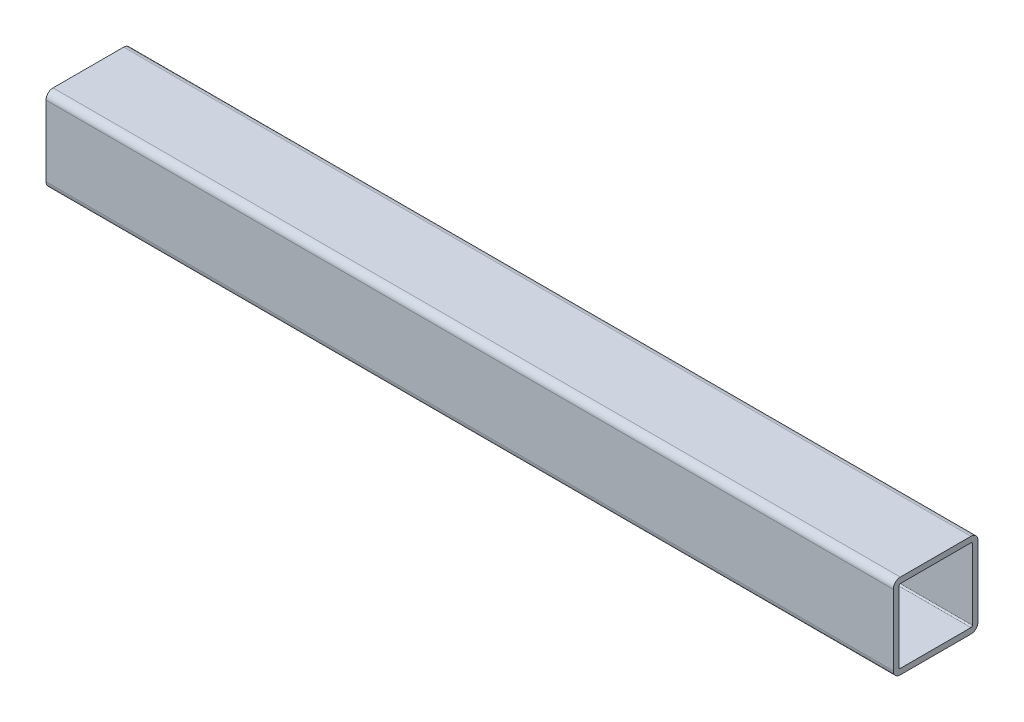
ISO-10303-21;
HEADER;
FILE_DESCRIPTION(('STEP AP214'),'2;1');
FILE_NAME('part.step','',(''),(''),'','','');
FILE_SCHEMA(('AUTOMOTIVE_DESIGN { 1 0 10303 214 1 1 1 1 }'));
ENDSEC;
DATA;
#1=APPLICATION_CONTEXT('core data for automotive mechanical design processes');
#2=APPLICATION_PROTOCOL_DEFINITION('international standard','automotive_design',2000,#1);
#3=PRODUCT_CONTEXT('',#1,'mechanical');
#4=PRODUCT('Part','Part','',(#3));
#5=PRODUCT_RELATED_PRODUCT_CATEGORY('part','',(#4));
#6=PRODUCT_DEFINITION_FORMATION('','',#4);
#7=PRODUCT_DEFINITION_CONTEXT('part definition',#1,'design');
#8=PRODUCT_DEFINITION('design','',#6,#7);
#9=PRODUCT_DEFINITION_SHAPE('','',#8);
#10=(LENGTH_UNIT() NAMED_UNIT(*) SI_UNIT(.MILLI.,.METRE.));
#11=(NAMED_UNIT(*) PLANE_ANGLE_UNIT() SI_UNIT($,.RADIAN.));
#12=(NAMED_UNIT(*) SI_UNIT($,.STERADIAN.) SOLID_ANGLE_UNIT());
#13=UNCERTAINTY_MEASURE_WITH_UNIT(LENGTH_MEASURE(1.E-05),#10,'distance_accuracy_value','');
#14=(GEOMETRIC_REPRESENTATION_CONTEXT(3) GLOBAL_UNCERTAINTY_ASSIGNED_CONTEXT((#13)) GLOBAL_UNIT_ASSIGNED_CONTEXT((#10,
#11,#12)) REPRESENTATION_CONTEXT('',''));
#15=CARTESIAN_POINT('',(0.,0.,0.));
#16=DIRECTION('',(0.,0.,1.));
#17=DIRECTION('',(1.,0.,0.));
#18=AXIS2_PLACEMENT_3D('',#15,#16,#17);
#19=CARTESIAN_POINT('',(190.5,-15.875,15.875));
#20=DIRECTION('',(1.,0.,0.));
#21=DIRECTION('',(0.,0.,-1.));
#22=AXIS2_PLACEMENT_3D('',#19,#20,#21);
#23=PLANE('',#22);
#24=CARTESIAN_POINT('',(190.5,-15.875,15.875));
#25=DIRECTION('',(1.,0.,0.));
#26=DIRECTION('',(0.,0.,-1.));
#27=AXIS2_PLACEMENT_3D('',#24,#25,#26);
#28=CIRCLE('',#27,3.175);
#29=CARTESIAN_POINT('',(190.5,-15.875,19.05));
#30=VERTEX_POINT('',#29);
#31=CARTESIAN_POINT('',(190.5,-19.05,15.875));
#32=VERTEX_POINT('',#31);
#33=EDGE_CURVE('E258',#30,#32,#28,.T.);
#34=ORIENTED_EDGE('',*,*,#33,.T.);
#35=DIRECTION('',(0.,0.,-1.));
#36=VECTOR('',#35,1.);
#37=CARTESIAN_POINT('',(190.5,-19.05,15.875));
#38=LINE('',#37,#36);
#39=CARTESIAN_POINT('',(190.5,-19.05,-15.875));
#40=VERTEX_POINT('',#39);
#41=EDGE_CURVE('E261',#32,#40,#38,.T.);
#42=ORIENTED_EDGE('',*,*,#41,.T.);
#43=CARTESIAN_POINT('',(190.5,-15.875,-15.875));
#44=DIRECTION('',(1.,0.,0.));
#45=DIRECTION('',(0.,0.,-1.));
#46=AXIS2_PLACEMENT_3D('',#43,#44,#45);
#47=CIRCLE('',#46,3.175);
#48=CARTESIAN_POINT('',(190.5,-15.875,-19.05));
#49=VERTEX_POINT('',#48);
#50=EDGE_CURVE('E264',#40,#49,#47,.T.);
#51=ORIENTED_EDGE('',*,*,#50,.T.);
#52=DIRECTION('',(0.,1.,0.));
#53=VECTOR('',#52,1.);
#54=CARTESIAN_POINT('',(190.5,15.875,-19.05));
#55=LINE('',#54,#53);
#56=CARTESIAN_POINT('',(190.5,15.875,-19.05));
#57=VERTEX_POINT('',#56);
#58=EDGE_CURVE('E266',#49,#57,#55,.T.);
#59=ORIENTED_EDGE('',*,*,#58,.T.);
#60=CARTESIAN_POINT('',(190.5,15.875,-15.875));
#61=DIRECTION('',(1.,0.,0.));
#62=DIRECTION('',(0.,0.,-1.));
#63=AXIS2_PLACEMENT_3D('',#60,#61,#62);
#64=CIRCLE('',#63,3.175);
#65=CARTESIAN_POINT('',(190.5,19.05,-15.875));
#66=VERTEX_POINT('',#65);
#67=EDGE_CURVE('E268',#57,#66,#64,.T.);
#68=ORIENTED_EDGE('',*,*,#67,.T.);
#69=DIRECTION('',(0.,0.,1.));
#70=VECTOR('',#69,1.);
#71=CARTESIAN_POINT('',(190.5,19.05,15.875));
#72=LINE('',#71,#70);
#73=CARTESIAN_POINT('',(190.5,19.05,15.875));
#74=VERTEX_POINT('',#73);
#75=EDGE_CURVE('E270',#66,#74,#72,.T.);
#76=ORIENTED_EDGE('',*,*,#75,.T.);
#77=CARTESIAN_POINT('',(190.5,15.875,15.875));
#78=DIRECTION('',(1.,0.,0.));
#79=DIRECTION('',(0.,0.,-1.));
#80=AXIS2_PLACEMENT_3D('',#77,#78,#79);
#81=CIRCLE('',#80,3.175);
#82=CARTESIAN_POINT('',(190.5,15.875,19.05));
#83=VERTEX_POINT('',#82);
#84=EDGE_CURVE('E272',#74,#83,#81,.T.);
#85=ORIENTED_EDGE('',*,*,#84,.T.);
#86=DIRECTION('',(0.,-1.,0.));
#87=VECTOR('',#86,1.);
#88=CARTESIAN_POINT('',(190.5,15.875,19.05));
#89=LINE('',#88,#87);
#90=EDGE_CURVE('E274',#83,#30,#89,.T.);
#91=ORIENTED_EDGE('',*,*,#90,.T.);
#92=EDGE_LOOP('',(#34,#42,#51,#59,#68,#76,#85,#91));
#93=FACE_BOUND('',#92,.T.);
#94=DIRECTION('',(0.,0.,-1.));
#95=VECTOR('',#94,1.);
#96=CARTESIAN_POINT('',(190.5,-16.51,15.875));
#97=LINE('',#96,#95);
#98=CARTESIAN_POINT('',(190.5,-16.51,15.875));
#99=VERTEX_POINT('',#98);
#100=CARTESIAN_POINT('',(190.5,-16.51,-15.875));
#101=VERTEX_POINT('',#100);
#102=EDGE_CURVE('E201',#99,#101,#97,.T.);
#103=ORIENTED_EDGE('',*,*,#102,.F.);
#104=CARTESIAN_POINT('',(190.5,-15.875,15.875));
#105=DIRECTION('',(1.,0.,0.));
#106=DIRECTION('',(0.,0.,-1.));
#107=AXIS2_PLACEMENT_3D('',#104,#105,#106);
#108=CIRCLE('',#107,0.635000000000002);
#109=CARTESIAN_POINT('',(190.5,-15.875,16.51));
#110=VERTEX_POINT('',#109);
#111=EDGE_CURVE('E193',#110,#99,#108,.T.);
#112=ORIENTED_EDGE('',*,*,#111,.F.);
#113=DIRECTION('',(0.,-1.,0.));
#114=VECTOR('',#113,1.);
#115=CARTESIAN_POINT('',(190.5,15.875,16.51));
#116=LINE('',#115,#114);
#117=CARTESIAN_POINT('',(190.5,15.875,16.51));
#118=VERTEX_POINT('',#117);
#119=EDGE_CURVE('E226',#118,#110,#116,.T.);
#120=ORIENTED_EDGE('',*,*,#119,.F.);
#121=CARTESIAN_POINT('',(190.5,15.875,15.875));
#122=DIRECTION('',(1.,0.,0.));
#123=DIRECTION('',(0.,0.,-1.));
#124=AXIS2_PLACEMENT_3D('',#121,#122,#123);
#125=CIRCLE('',#124,0.635000000000004);
#126=CARTESIAN_POINT('',(190.5,16.51,15.875));
#127=VERTEX_POINT('',#126);
#128=EDGE_CURVE('E224',#127,#118,#125,.T.);
#129=ORIENTED_EDGE('',*,*,#128,.F.);
#130=DIRECTION('',(0.,0.,1.));
#131=VECTOR('',#130,1.);
#132=CARTESIAN_POINT('',(190.5,16.51,15.875));
#133=LINE('',#132,#131);
#134=CARTESIAN_POINT('',(190.5,16.51,-15.875));
#135=VERTEX_POINT('',#134);
#136=EDGE_CURVE('E222',#135,#127,#133,.T.);
#137=ORIENTED_EDGE('',*,*,#136,.F.);
#138=CARTESIAN_POINT('',(190.5,15.875,-15.875));
#139=DIRECTION('',(1.,0.,0.));
#140=DIRECTION('',(0.,0.,-1.));
#141=AXIS2_PLACEMENT_3D('',#138,#139,#140);
#142=CIRCLE('',#141,0.635000000000004);
#143=CARTESIAN_POINT('',(190.5,15.875,-16.51));
#144=VERTEX_POINT('',#143);
#145=EDGE_CURVE('E220',#144,#135,#142,.T.);
#146=ORIENTED_EDGE('',*,*,#145,.F.);
#147=DIRECTION('',(0.,1.,0.));
#148=VECTOR('',#147,1.);
#149=CARTESIAN_POINT('',(190.5,15.875,-16.51));
#150=LINE('',#149,#148);
#151=CARTESIAN_POINT('',(190.5,-15.875,-16.51));
#152=VERTEX_POINT('',#151);
#153=EDGE_CURVE('E216',#152,#144,#150,.T.);
#154=ORIENTED_EDGE('',*,*,#153,.F.);
#155=CARTESIAN_POINT('',(190.5,-15.875,-15.875));
#156=DIRECTION('',(1.,0.,0.));
#157=DIRECTION('',(0.,0.,-1.));
#158=AXIS2_PLACEMENT_3D('',#155,#156,#157);
#159=CIRCLE('',#158,0.634999999999999);
#160=EDGE_CURVE('E214',#101,#152,#159,.T.);
#161=ORIENTED_EDGE('',*,*,#160,.F.);
#162=EDGE_LOOP('',(#103,#112,#120,#129,#137,#146,#154,#161));
#163=FACE_BOUND('',#162,.T.);
#164=ADVANCED_FACE('F80',(#93,#163),#23,.T.);
#165=CARTESIAN_POINT('',(-190.5,-15.875,15.875));
#166=DIRECTION('',(1.,0.,0.));
#167=DIRECTION('',(0.,0.,-1.));
#168=AXIS2_PLACEMENT_3D('',#165,#166,#167);
#169=PLANE('',#168);
#170=CARTESIAN_POINT('',(-190.5,-15.875,15.875));
#171=DIRECTION('',(1.,0.,0.));
#172=DIRECTION('',(0.,0.,-1.));
#173=AXIS2_PLACEMENT_3D('',#170,#171,#172);
#174=CIRCLE('',#173,3.175);
#175=CARTESIAN_POINT('',(-190.5,-15.875,19.05));
#176=VERTEX_POINT('',#175);
#177=CARTESIAN_POINT('',(-190.5,-19.05,15.875));
#178=VERTEX_POINT('',#177);
#179=EDGE_CURVE('E209',#176,#178,#174,.T.);
#180=ORIENTED_EDGE('',*,*,#179,.F.);
#181=DIRECTION('',(0.,-1.,0.));
#182=VECTOR('',#181,1.);
#183=CARTESIAN_POINT('',(-190.5,15.875,19.05));
#184=LINE('',#183,#182);
#185=CARTESIAN_POINT('',(-190.5,15.875,19.05));
#186=VERTEX_POINT('',#185);
#187=EDGE_CURVE('E262',#186,#176,#184,.T.);
#188=ORIENTED_EDGE('',*,*,#187,.F.);
#189=CARTESIAN_POINT('',(-190.5,15.875,15.875));
#190=DIRECTION('',(1.,0.,0.));
#191=DIRECTION('',(0.,0.,-1.));
#192=AXIS2_PLACEMENT_3D('',#189,#190,#191);
#193=CIRCLE('',#192,3.175);
#194=CARTESIAN_POINT('',(-190.5,19.05,15.875));
#195=VERTEX_POINT('',#194);
#196=EDGE_CURVE('E289',#195,#186,#193,.T.);
#197=ORIENTED_EDGE('',*,*,#196,.F.);
#198=DIRECTION('',(0.,0.,1.));
#199=VECTOR('',#198,1.);
#200=CARTESIAN_POINT('',(-190.5,19.05,15.875));
#201=LINE('',#200,#199);
#202=CARTESIAN_POINT('',(-190.5,19.05,-15.875));
#203=VERTEX_POINT('',#202);
#204=EDGE_CURVE('E287',#203,#195,#201,.T.);
#205=ORIENTED_EDGE('',*,*,#204,.F.);
#206=CARTESIAN_POINT('',(-190.5,15.875,-15.875));
#207=DIRECTION('',(1.,0.,0.));
#208=DIRECTION('',(0.,0.,-1.));
#209=AXIS2_PLACEMENT_3D('',#206,#207,#208);
#210=CIRCLE('',#209,3.175);
#211=CARTESIAN_POINT('',(-190.5,15.875,-19.05));
#212=VERTEX_POINT('',#211);
#213=EDGE_CURVE('E285',#212,#203,#210,.T.);
#214=ORIENTED_EDGE('',*,*,#213,.F.);
#215=DIRECTION('',(0.,1.,0.));
#216=VECTOR('',#215,1.);
#217=CARTESIAN_POINT('',(-190.5,15.875,-19.05));
#218=LINE('',#217,#216);
#219=CARTESIAN_POINT('',(-190.5,-15.875,-19.05));
#220=VERTEX_POINT('',#219);
#221=EDGE_CURVE('E283',#220,#212,#218,.T.);
#222=ORIENTED_EDGE('',*,*,#221,.F.);
#223=CARTESIAN_POINT('',(-190.5,-15.875,-15.875));
#224=DIRECTION('',(1.,0.,0.));
#225=DIRECTION('',(0.,0.,-1.));
#226=AXIS2_PLACEMENT_3D('',#223,#224,#225);
#227=CIRCLE('',#226,3.175);
#228=CARTESIAN_POINT('',(-190.5,-19.05,-15.875));
#229=VERTEX_POINT('',#228);
#230=EDGE_CURVE('E281',#229,#220,#227,.T.);
#231=ORIENTED_EDGE('',*,*,#230,.F.);
#232=DIRECTION('',(0.,0.,-1.));
#233=VECTOR('',#232,1.);
#234=CARTESIAN_POINT('',(-190.5,-19.05,15.875));
#235=LINE('',#234,#233);
#236=EDGE_CURVE('E279',#178,#229,#235,.T.);
#237=ORIENTED_EDGE('',*,*,#236,.F.);
#238=EDGE_LOOP('',(#180,#188,#197,#205,#214,#222,#231,#237));
#239=FACE_BOUND('',#238,.T.);
#240=CARTESIAN_POINT('',(-190.5,-15.875,15.875));
#241=DIRECTION('',(1.,0.,0.));
#242=DIRECTION('',(0.,0.,-1.));
#243=AXIS2_PLACEMENT_3D('',#240,#241,#242);
#244=CIRCLE('',#243,0.635000000000002);
#245=CARTESIAN_POINT('',(-190.5,-15.875,16.51));
#246=VERTEX_POINT('',#245);
#247=CARTESIAN_POINT('',(-190.5,-16.51,15.875));
#248=VERTEX_POINT('',#247);
#249=EDGE_CURVE('E103',#246,#248,#244,.T.);
#250=ORIENTED_EDGE('',*,*,#249,.T.);
#251=DIRECTION('',(0.,0.,-1.));
#252=VECTOR('',#251,1.);
#253=CARTESIAN_POINT('',(-190.5,-16.51,15.875));
#254=LINE('',#253,#252);
#255=CARTESIAN_POINT('',(-190.5,-16.51,-15.875));
#256=VERTEX_POINT('',#255);
#257=EDGE_CURVE('E208',#248,#256,#254,.T.);
#258=ORIENTED_EDGE('',*,*,#257,.T.);
#259=CARTESIAN_POINT('',(-190.5,-15.875,-15.875));
#260=DIRECTION('',(1.,0.,0.));
#261=DIRECTION('',(0.,0.,-1.));
#262=AXIS2_PLACEMENT_3D('',#259,#260,#261);
#263=CIRCLE('',#262,0.634999999999999);
#264=CARTESIAN_POINT('',(-190.5,-15.875,-16.51));
#265=VERTEX_POINT('',#264);
#266=EDGE_CURVE('E230',#256,#265,#263,.T.);
#267=ORIENTED_EDGE('',*,*,#266,.T.);
#268=DIRECTION('',(0.,1.,0.));
#269=VECTOR('',#268,1.);
#270=CARTESIAN_POINT('',(-190.5,15.875,-16.51));
#271=LINE('',#270,#269);
#272=CARTESIAN_POINT('',(-190.5,15.875,-16.51));
#273=VERTEX_POINT('',#272);
#274=EDGE_CURVE('E233',#265,#273,#271,.T.);
#275=ORIENTED_EDGE('',*,*,#274,.T.);
#276=CARTESIAN_POINT('',(-190.5,15.875,-15.875));
#277=DIRECTION('',(1.,0.,0.));
#278=DIRECTION('',(0.,0.,-1.));
#279=AXIS2_PLACEMENT_3D('',#276,#277,#278);
#280=CIRCLE('',#279,0.635000000000004);
#281=CARTESIAN_POINT('',(-190.5,16.51,-15.875));
#282=VERTEX_POINT('',#281);
#283=EDGE_CURVE('E236',#273,#282,#280,.T.);
#284=ORIENTED_EDGE('',*,*,#283,.T.);
#285=DIRECTION('',(0.,0.,1.));
#286=VECTOR('',#285,1.);
#287=CARTESIAN_POINT('',(-190.5,16.51,15.875));
#288=LINE('',#287,#286);
#289=CARTESIAN_POINT('',(-190.5,16.51,15.875));
#290=VERTEX_POINT('',#289);
#291=EDGE_CURVE('E239',#282,#290,#288,.T.);
#292=ORIENTED_EDGE('',*,*,#291,.T.);
#293=CARTESIAN_POINT('',(-190.5,15.875,15.875));
#294=DIRECTION('',(1.,0.,0.));
#295=DIRECTION('',(0.,0.,-1.));
#296=AXIS2_PLACEMENT_3D('',#293,#294,#295);
#297=CIRCLE('',#296,0.635000000000004);
#298=CARTESIAN_POINT('',(-190.5,15.875,16.51));
#299=VERTEX_POINT('',#298);
#300=EDGE_CURVE('E242',#290,#299,#297,.T.);
#301=ORIENTED_EDGE('',*,*,#300,.T.);
#302=DIRECTION('',(0.,-1.,0.));
#303=VECTOR('',#302,1.);
#304=CARTESIAN_POINT('',(-190.5,15.875,16.51));
#305=LINE('',#304,#303);
#306=EDGE_CURVE('E202',#299,#246,#305,.T.);
#307=ORIENTED_EDGE('',*,*,#306,.T.);
#308=EDGE_LOOP('',(#250,#258,#267,#275,#284,#292,#301,#307));
#309=FACE_BOUND('',#308,.T.);
#310=ADVANCED_FACE('F319',(#239,#309),#169,.F.);
#311=CARTESIAN_POINT('',(190.5,-15.875,15.875));
#312=DIRECTION('',(-1.,0.,0.));
#313=DIRECTION('',(0.,0.,1.));
#314=AXIS2_PLACEMENT_3D('',#311,#312,#313);
#315=CYLINDRICAL_SURFACE('',#314,3.175);
#316=ORIENTED_EDGE('',*,*,#179,.T.);
#317=DIRECTION('',(-1.,0.,0.));
#318=VECTOR('',#317,1.);
#319=CARTESIAN_POINT('',(190.5,-19.05,15.875));
#320=LINE('',#319,#318);
#321=EDGE_CURVE('E12',#32,#178,#320,.T.);
#322=ORIENTED_EDGE('',*,*,#321,.F.);
#323=ORIENTED_EDGE('',*,*,#33,.F.);
#324=DIRECTION('',(-1.,0.,0.));
#325=VECTOR('',#324,1.);
#326=CARTESIAN_POINT('',(190.5,-15.875,19.05));
#327=LINE('',#326,#325);
#328=EDGE_CURVE('E276',#30,#176,#327,.T.);
#329=ORIENTED_EDGE('',*,*,#328,.T.);
#330=EDGE_LOOP('',(#316,#322,#323,#329));
#331=FACE_BOUND('',#330,.T.);
#332=ADVANCED_FACE('F82',(#331),#315,.T.);
#333=CARTESIAN_POINT('',(190.5,-19.05,15.875));
#334=DIRECTION('',(0.,1.,0.));
#335=DIRECTION('',(0.,0.,1.));
#336=AXIS2_PLACEMENT_3D('',#333,#334,#335);
#337=PLANE('',#336);
#338=ORIENTED_EDGE('',*,*,#236,.T.);
#339=DIRECTION('',(-1.,0.,0.));
#340=VECTOR('',#339,1.);
#341=CARTESIAN_POINT('',(190.5,-19.05,-15.875));
#342=LINE('',#341,#340);
#343=EDGE_CURVE('E88',#40,#229,#342,.T.);
#344=ORIENTED_EDGE('',*,*,#343,.F.);
#345=ORIENTED_EDGE('',*,*,#41,.F.);
#346=ORIENTED_EDGE('',*,*,#321,.T.);
#347=EDGE_LOOP('',(#338,#344,#345,#346));
#348=FACE_BOUND('',#347,.T.);
#349=ADVANCED_FACE('F336',(#348),#337,.F.);
#350=CARTESIAN_POINT('',(190.5,-15.875,-15.875));
#351=DIRECTION('',(-1.,0.,0.));
#352=DIRECTION('',(0.,0.,1.));
#353=AXIS2_PLACEMENT_3D('',#350,#351,#352);
#354=CYLINDRICAL_SURFACE('',#353,3.175);
#355=ORIENTED_EDGE('',*,*,#230,.T.);
#356=DIRECTION('',(-1.,0.,0.));
#357=VECTOR('',#356,1.);
#358=CARTESIAN_POINT('',(190.5,-15.875,-19.05));
#359=LINE('',#358,#357);
#360=EDGE_CURVE('E306',#49,#220,#359,.T.);
#361=ORIENTED_EDGE('',*,*,#360,.F.);
#362=ORIENTED_EDGE('',*,*,#50,.F.);
#363=ORIENTED_EDGE('',*,*,#343,.T.);
#364=EDGE_LOOP('',(#355,#361,#362,#363));
#365=FACE_BOUND('',#364,.T.);
#366=ADVANCED_FACE('F313',(#365),#354,.T.);
#367=CARTESIAN_POINT('',(190.5,15.875,-19.05));
#368=DIRECTION('',(0.,0.,1.));
#369=DIRECTION('',(0.,-1.,0.));
#370=AXIS2_PLACEMENT_3D('',#367,#368,#369);
#371=PLANE('',#370);
#372=ORIENTED_EDGE('',*,*,#221,.T.);
#373=DIRECTION('',(-1.,0.,0.));
#374=VECTOR('',#373,1.);
#375=CARTESIAN_POINT('',(190.5,15.875,-19.05));
#376=LINE('',#375,#374);
#377=EDGE_CURVE('E303',#57,#212,#376,.T.);
#378=ORIENTED_EDGE('',*,*,#377,.F.);
#379=ORIENTED_EDGE('',*,*,#58,.F.);
#380=ORIENTED_EDGE('',*,*,#360,.T.);
#381=EDGE_LOOP('',(#372,#378,#379,#380));
#382=FACE_BOUND('',#381,.T.);
#383=ADVANCED_FACE('F325',(#382),#371,.F.);
#384=CARTESIAN_POINT('',(190.5,15.875,-15.875));
#385=DIRECTION('',(-1.,0.,0.));
#386=DIRECTION('',(0.,0.,1.));
#387=AXIS2_PLACEMENT_3D('',#384,#385,#386);
#388=CYLINDRICAL_SURFACE('',#387,3.175);
#389=ORIENTED_EDGE('',*,*,#213,.T.);
#390=DIRECTION('',(-1.,0.,0.));
#391=VECTOR('',#390,1.);
#392=CARTESIAN_POINT('',(190.5,19.05,-15.875));
#393=LINE('',#392,#391);
#394=EDGE_CURVE('E300',#66,#203,#393,.T.);
#395=ORIENTED_EDGE('',*,*,#394,.F.);
#396=ORIENTED_EDGE('',*,*,#67,.F.);
#397=ORIENTED_EDGE('',*,*,#377,.T.);
#398=EDGE_LOOP('',(#389,#395,#396,#397));
#399=FACE_BOUND('',#398,.T.);
#400=ADVANCED_FACE('F329',(#399),#388,.T.);
#401=CARTESIAN_POINT('',(190.5,19.05,15.875));
#402=DIRECTION('',(0.,-1.,0.));
#403=DIRECTION('',(0.,0.,-1.));
#404=AXIS2_PLACEMENT_3D('',#401,#402,#403);
#405=PLANE('',#404);
#406=ORIENTED_EDGE('',*,*,#204,.T.);
#407=DIRECTION('',(-1.,0.,0.));
#408=VECTOR('',#407,1.);
#409=CARTESIAN_POINT('',(190.5,19.05,15.875));
#410=LINE('',#409,#408);
#411=EDGE_CURVE('E297',#74,#195,#410,.T.);
#412=ORIENTED_EDGE('',*,*,#411,.F.);
#413=ORIENTED_EDGE('',*,*,#75,.F.);
#414=ORIENTED_EDGE('',*,*,#394,.T.);
#415=EDGE_LOOP('',(#406,#412,#413,#414));
#416=FACE_BOUND('',#415,.T.);
#417=ADVANCED_FACE('F349',(#416),#405,.F.);
#418=CARTESIAN_POINT('',(190.5,15.875,15.875));
#419=DIRECTION('',(-1.,0.,0.));
#420=DIRECTION('',(0.,0.,1.));
#421=AXIS2_PLACEMENT_3D('',#418,#419,#420);
#422=CYLINDRICAL_SURFACE('',#421,3.175);
#423=ORIENTED_EDGE('',*,*,#196,.T.);
#424=DIRECTION('',(-1.,0.,0.));
#425=VECTOR('',#424,1.);
#426=CARTESIAN_POINT('',(190.5,15.875,19.05));
#427=LINE('',#426,#425);
#428=EDGE_CURVE('E294',#83,#186,#427,.T.);
#429=ORIENTED_EDGE('',*,*,#428,.F.);
#430=ORIENTED_EDGE('',*,*,#84,.F.);
#431=ORIENTED_EDGE('',*,*,#411,.T.);
#432=EDGE_LOOP('',(#423,#429,#430,#431));
#433=FACE_BOUND('',#432,.T.);
#434=ADVANCED_FACE('F347',(#433),#422,.T.);
#435=CARTESIAN_POINT('',(190.5,15.875,19.05));
#436=DIRECTION('',(0.,0.,-1.));
#437=DIRECTION('',(0.,1.,0.));
#438=AXIS2_PLACEMENT_3D('',#435,#436,#437);
#439=PLANE('',#438);
#440=ORIENTED_EDGE('',*,*,#187,.T.);
#441=ORIENTED_EDGE('',*,*,#328,.F.);
#442=ORIENTED_EDGE('',*,*,#90,.F.);
#443=ORIENTED_EDGE('',*,*,#428,.T.);
#444=EDGE_LOOP('',(#440,#441,#442,#443));
#445=FACE_BOUND('',#444,.T.);
#446=ADVANCED_FACE('F342',(#445),#439,.F.);
#447=CARTESIAN_POINT('',(190.5,-15.875,15.875));
#448=DIRECTION('',(-1.,0.,0.));
#449=DIRECTION('',(0.,0.,1.));
#450=AXIS2_PLACEMENT_3D('',#447,#448,#449);
#451=CYLINDRICAL_SURFACE('',#450,0.635000000000002);
#452=ORIENTED_EDGE('',*,*,#249,.F.);
#453=DIRECTION('',(-1.,0.,0.));
#454=VECTOR('',#453,1.);
#455=CARTESIAN_POINT('',(190.5,-15.875,16.51));
#456=LINE('',#455,#454);
#457=EDGE_CURVE('E197',#110,#246,#456,.T.);
#458=ORIENTED_EDGE('',*,*,#457,.F.);
#459=ORIENTED_EDGE('',*,*,#111,.T.);
#460=DIRECTION('',(-1.,0.,0.));
#461=VECTOR('',#460,1.);
#462=CARTESIAN_POINT('',(190.5,-16.51,15.875));
#463=LINE('',#462,#461);
#464=EDGE_CURVE('E196',#99,#248,#463,.T.);
#465=ORIENTED_EDGE('',*,*,#464,.T.);
#466=EDGE_LOOP('',(#452,#458,#459,#465));
#467=FACE_BOUND('',#466,.T.);
#468=ADVANCED_FACE('F195',(#467),#451,.F.);
#469=CARTESIAN_POINT('',(190.5,-16.51,15.875));
#470=DIRECTION('',(0.,1.,0.));
#471=DIRECTION('',(0.,0.,1.));
#472=AXIS2_PLACEMENT_3D('',#469,#470,#471);
#473=PLANE('',#472);
#474=ORIENTED_EDGE('',*,*,#257,.F.);
#475=ORIENTED_EDGE('',*,*,#464,.F.);
#476=ORIENTED_EDGE('',*,*,#102,.T.);
#477=DIRECTION('',(-1.,0.,0.));
#478=VECTOR('',#477,1.);
#479=CARTESIAN_POINT('',(190.5,-16.51,-15.875));
#480=LINE('',#479,#478);
#481=EDGE_CURVE('E210',#101,#256,#480,.T.);
#482=ORIENTED_EDGE('',*,*,#481,.T.);
#483=EDGE_LOOP('',(#474,#475,#476,#482));
#484=FACE_BOUND('',#483,.T.);
#485=ADVANCED_FACE('F205',(#484),#473,.T.);
#486=CARTESIAN_POINT('',(190.5,-15.875,-15.875));
#487=DIRECTION('',(-1.,0.,0.));
#488=DIRECTION('',(0.,0.,1.));
#489=AXIS2_PLACEMENT_3D('',#486,#487,#488);
#490=CYLINDRICAL_SURFACE('',#489,0.634999999999999);
#491=ORIENTED_EDGE('',*,*,#266,.F.);
#492=ORIENTED_EDGE('',*,*,#481,.F.);
#493=ORIENTED_EDGE('',*,*,#160,.T.);
#494=DIRECTION('',(-1.,0.,0.));
#495=VECTOR('',#494,1.);
#496=CARTESIAN_POINT('',(190.5,-15.875,-16.51));
#497=LINE('',#496,#495);
#498=EDGE_CURVE('E255',#152,#265,#497,.T.);
#499=ORIENTED_EDGE('',*,*,#498,.T.);
#500=EDGE_LOOP('',(#491,#492,#493,#499));
#501=FACE_BOUND('',#500,.T.);
#502=ADVANCED_FACE('F374',(#501),#490,.F.);
#503=CARTESIAN_POINT('',(190.5,15.875,-16.51));
#504=DIRECTION('',(0.,0.,1.));
#505=DIRECTION('',(0.,-1.,0.));
#506=AXIS2_PLACEMENT_3D('',#503,#504,#505);
#507=PLANE('',#506);
#508=ORIENTED_EDGE('',*,*,#274,.F.);
#509=ORIENTED_EDGE('',*,*,#498,.F.);
#510=ORIENTED_EDGE('',*,*,#153,.T.);
#511=DIRECTION('',(-1.,0.,0.));
#512=VECTOR('',#511,1.);
#513=CARTESIAN_POINT('',(190.5,15.875,-16.51));
#514=LINE('',#513,#512);
#515=EDGE_CURVE('E253',#144,#273,#514,.T.);
#516=ORIENTED_EDGE('',*,*,#515,.T.);
#517=EDGE_LOOP('',(#508,#509,#510,#516));
#518=FACE_BOUND('',#517,.T.);
#519=ADVANCED_FACE('F378',(#518),#507,.T.);
#520=CARTESIAN_POINT('',(190.5,15.875,-15.875));
#521=DIRECTION('',(-1.,0.,0.));
#522=DIRECTION('',(0.,0.,1.));
#523=AXIS2_PLACEMENT_3D('',#520,#521,#522);
#524=CYLINDRICAL_SURFACE('',#523,0.635000000000004);
#525=ORIENTED_EDGE('',*,*,#283,.F.);
#526=ORIENTED_EDGE('',*,*,#515,.F.);
#527=ORIENTED_EDGE('',*,*,#145,.T.);
#528=DIRECTION('',(-1.,0.,0.));
#529=VECTOR('',#528,1.);
#530=CARTESIAN_POINT('',(190.5,16.51,-15.875));
#531=LINE('',#530,#529);
#532=EDGE_CURVE('E251',#135,#282,#531,.T.);
#533=ORIENTED_EDGE('',*,*,#532,.T.);
#534=EDGE_LOOP('',(#525,#526,#527,#533));
#535=FACE_BOUND('',#534,.T.);
#536=ADVANCED_FACE('F384',(#535),#524,.F.);
#537=CARTESIAN_POINT('',(190.5,16.51,15.875));
#538=DIRECTION('',(0.,-1.,0.));
#539=DIRECTION('',(0.,0.,-1.));
#540=AXIS2_PLACEMENT_3D('',#537,#538,#539);
#541=PLANE('',#540);
#542=ORIENTED_EDGE('',*,*,#291,.F.);
#543=ORIENTED_EDGE('',*,*,#532,.F.);
#544=ORIENTED_EDGE('',*,*,#136,.T.);
#545=DIRECTION('',(-1.,0.,0.));
#546=VECTOR('',#545,1.);
#547=CARTESIAN_POINT('',(190.5,16.51,15.875));
#548=LINE('',#547,#546);
#549=EDGE_CURVE('E249',#127,#290,#548,.T.);
#550=ORIENTED_EDGE('',*,*,#549,.T.);
#551=EDGE_LOOP('',(#542,#543,#544,#550));
#552=FACE_BOUND('',#551,.T.);
#553=ADVANCED_FACE('F388',(#552),#541,.T.);
#554=CARTESIAN_POINT('',(190.5,15.875,15.875));
#555=DIRECTION('',(-1.,0.,0.));
#556=DIRECTION('',(0.,0.,1.));
#557=AXIS2_PLACEMENT_3D('',#554,#555,#556);
#558=CYLINDRICAL_SURFACE('',#557,0.635000000000004);
#559=ORIENTED_EDGE('',*,*,#300,.F.);
#560=ORIENTED_EDGE('',*,*,#549,.F.);
#561=ORIENTED_EDGE('',*,*,#128,.T.);
#562=DIRECTION('',(-1.,0.,0.));
#563=VECTOR('',#562,1.);
#564=CARTESIAN_POINT('',(190.5,15.875,16.51));
#565=LINE('',#564,#563);
#566=EDGE_CURVE('E95',#118,#299,#565,.T.);
#567=ORIENTED_EDGE('',*,*,#566,.T.);
#568=EDGE_LOOP('',(#559,#560,#561,#567));
#569=FACE_BOUND('',#568,.T.);
#570=ADVANCED_FACE('F392',(#569),#558,.F.);
#571=CARTESIAN_POINT('',(190.5,15.875,16.51));
#572=DIRECTION('',(0.,0.,-1.));
#573=DIRECTION('',(0.,1.,0.));
#574=AXIS2_PLACEMENT_3D('',#571,#572,#573);
#575=PLANE('',#574);
#576=ORIENTED_EDGE('',*,*,#306,.F.);
#577=ORIENTED_EDGE('',*,*,#566,.F.);
#578=ORIENTED_EDGE('',*,*,#119,.T.);
#579=ORIENTED_EDGE('',*,*,#457,.T.);
#580=EDGE_LOOP('',(#576,#577,#578,#579));
#581=FACE_BOUND('',#580,.T.);
#582=ADVANCED_FACE('F396',(#581),#575,.T.);
#583=CLOSED_SHELL('',(#164,#310,#332,#349,#366,#383,#400,#417,#434,#446,#468,#485,#502,#519,
#536,#553,#570,#582));
#584=MANIFOLD_SOLID_BREP('B2',#583);
#585=ADVANCED_BREP_SHAPE_REPRESENTATION('',(#18,#584),#14);
#586=SHAPE_DEFINITION_REPRESENTATION(#9,#585);
ENDSEC;
END-ISO-10303-21;
